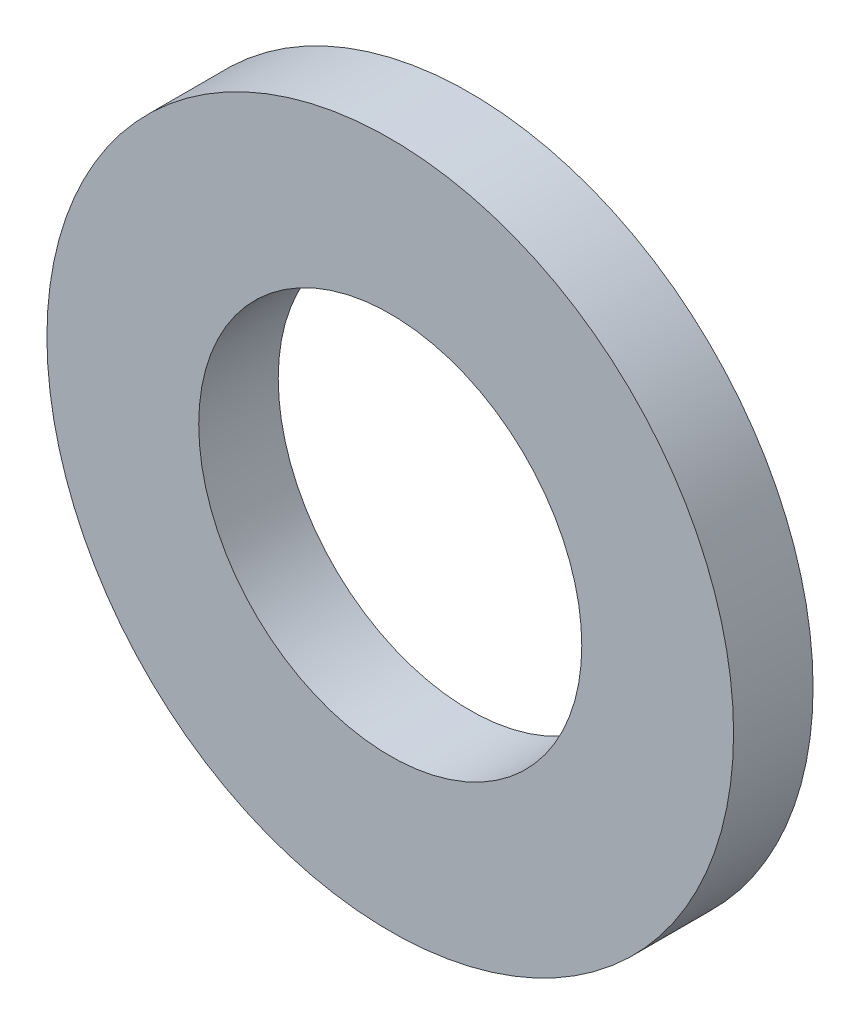
ISO-10303-21;
HEADER;
FILE_DESCRIPTION(('STEP AP214'),'2;1');
FILE_NAME('part.step','',(''),(''),'','','');
FILE_SCHEMA(('AUTOMOTIVE_DESIGN { 1 0 10303 214 1 1 1 1 }'));
ENDSEC;
DATA;
#1=APPLICATION_CONTEXT('core data for automotive mechanical design processes');
#2=APPLICATION_PROTOCOL_DEFINITION('international standard','automotive_design',2000,#1);
#3=PRODUCT_CONTEXT('',#1,'mechanical');
#4=PRODUCT('Part','Part','',(#3));
#5=PRODUCT_RELATED_PRODUCT_CATEGORY('part','',(#4));
#6=PRODUCT_DEFINITION_FORMATION('','',#4);
#7=PRODUCT_DEFINITION_CONTEXT('part definition',#1,'design');
#8=PRODUCT_DEFINITION('design','',#6,#7);
#9=PRODUCT_DEFINITION_SHAPE('','',#8);
#10=(LENGTH_UNIT() NAMED_UNIT(*) SI_UNIT(.MILLI.,.METRE.));
#11=(NAMED_UNIT(*) PLANE_ANGLE_UNIT() SI_UNIT($,.RADIAN.));
#12=(NAMED_UNIT(*) SI_UNIT($,.STERADIAN.) SOLID_ANGLE_UNIT());
#13=UNCERTAINTY_MEASURE_WITH_UNIT(LENGTH_MEASURE(1.E-05),#10,'distance_accuracy_value','');
#14=(GEOMETRIC_REPRESENTATION_CONTEXT(3) GLOBAL_UNCERTAINTY_ASSIGNED_CONTEXT((#13)) GLOBAL_UNIT_ASSIGNED_CONTEXT((#10,
#11,#12)) REPRESENTATION_CONTEXT('',''));
#15=CARTESIAN_POINT('',(0.,0.,0.));
#16=DIRECTION('',(0.,0.,1.));
#17=DIRECTION('',(1.,0.,0.));
#18=AXIS2_PLACEMENT_3D('',#15,#16,#17);
#19=CARTESIAN_POINT('',(0.,0.,1.1));
#20=DIRECTION('',(0.,0.,1.));
#21=DIRECTION('',(1.,0.,0.));
#22=AXIS2_PLACEMENT_3D('',#19,#20,#21);
#23=PLANE('',#22);
#24=CARTESIAN_POINT('',(0.,0.,1.1));
#25=DIRECTION('',(0.,0.,1.));
#26=DIRECTION('',(1.,0.,0.));
#27=AXIS2_PLACEMENT_3D('',#24,#25,#26);
#28=CIRCLE('',#27,4.75);
#29=CARTESIAN_POINT('',(4.75,0.,1.1));
#30=VERTEX_POINT('',#29);
#31=EDGE_CURVE('E10',#30,#30,#28,.T.);
#32=ORIENTED_EDGE('',*,*,#31,.T.);
#33=EDGE_LOOP('',(#32));
#34=FACE_BOUND('',#33,.T.);
#35=CARTESIAN_POINT('',(0.,0.,1.1));
#36=DIRECTION('',(0.,0.,1.));
#37=DIRECTION('',(1.,0.,0.));
#38=AXIS2_PLACEMENT_3D('',#35,#36,#37);
#39=CIRCLE('',#38,2.65);
#40=CARTESIAN_POINT('',(2.65,0.,1.1));
#41=VERTEX_POINT('',#40);
#42=EDGE_CURVE('E41',#41,#41,#39,.T.);
#43=ORIENTED_EDGE('',*,*,#42,.F.);
#44=EDGE_LOOP('',(#43));
#45=FACE_BOUND('',#44,.T.);
#46=ADVANCED_FACE('F30',(#34,#45),#23,.T.);
#47=CARTESIAN_POINT('',(0.,0.,0.));
#48=DIRECTION('',(0.,0.,1.));
#49=DIRECTION('',(1.,0.,0.));
#50=AXIS2_PLACEMENT_3D('',#47,#48,#49);
#51=PLANE('',#50);
#52=CARTESIAN_POINT('',(0.,0.,0.));
#53=DIRECTION('',(0.,0.,1.));
#54=DIRECTION('',(1.,0.,0.));
#55=AXIS2_PLACEMENT_3D('',#52,#53,#54);
#56=CIRCLE('',#55,4.75);
#57=CARTESIAN_POINT('',(4.75,0.,0.));
#58=VERTEX_POINT('',#57);
#59=EDGE_CURVE('E34',#58,#58,#56,.T.);
#60=ORIENTED_EDGE('',*,*,#59,.F.);
#61=EDGE_LOOP('',(#60));
#62=FACE_BOUND('',#61,.T.);
#63=CARTESIAN_POINT('',(0.,0.,0.));
#64=DIRECTION('',(0.,0.,1.));
#65=DIRECTION('',(1.,0.,0.));
#66=AXIS2_PLACEMENT_3D('',#63,#64,#65);
#67=CIRCLE('',#66,2.65);
#68=CARTESIAN_POINT('',(2.65,0.,0.));
#69=VERTEX_POINT('',#68);
#70=EDGE_CURVE('E43',#69,#69,#67,.T.);
#71=ORIENTED_EDGE('',*,*,#70,.T.);
#72=EDGE_LOOP('',(#71));
#73=FACE_BOUND('',#72,.T.);
#74=ADVANCED_FACE('F53',(#62,#73),#51,.F.);
#75=CARTESIAN_POINT('',(0.,0.,1.1));
#76=DIRECTION('',(0.,0.,-1.));
#77=DIRECTION('',(-1.,0.,0.));
#78=AXIS2_PLACEMENT_3D('',#75,#76,#77);
#79=CYLINDRICAL_SURFACE('',#78,4.75);
#80=ORIENTED_EDGE('',*,*,#31,.F.);
#81=EDGE_LOOP('',(#80));
#82=FACE_BOUND('',#81,.T.);
#83=ORIENTED_EDGE('',*,*,#59,.T.);
#84=EDGE_LOOP('',(#83));
#85=FACE_BOUND('',#84,.T.);
#86=ADVANCED_FACE('F32',(#82,#85),#79,.T.);
#87=CARTESIAN_POINT('',(0.,0.,1.1));
#88=DIRECTION('',(0.,0.,-1.));
#89=DIRECTION('',(-1.,0.,0.));
#90=AXIS2_PLACEMENT_3D('',#87,#88,#89);
#91=CYLINDRICAL_SURFACE('',#90,2.65);
#92=ORIENTED_EDGE('',*,*,#42,.T.);
#93=EDGE_LOOP('',(#92));
#94=FACE_BOUND('',#93,.T.);
#95=ORIENTED_EDGE('',*,*,#70,.F.);
#96=EDGE_LOOP('',(#95));
#97=FACE_BOUND('',#96,.T.);
#98=ADVANCED_FACE('F49',(#94,#97),#91,.F.);
#99=CLOSED_SHELL('',(#46,#74,#86,#98));
#100=MANIFOLD_SOLID_BREP('B2',#99);
#101=ADVANCED_BREP_SHAPE_REPRESENTATION('',(#18,#100),#14);
#102=SHAPE_DEFINITION_REPRESENTATION(#9,#101);
ENDSEC;
END-ISO-10303-21;
